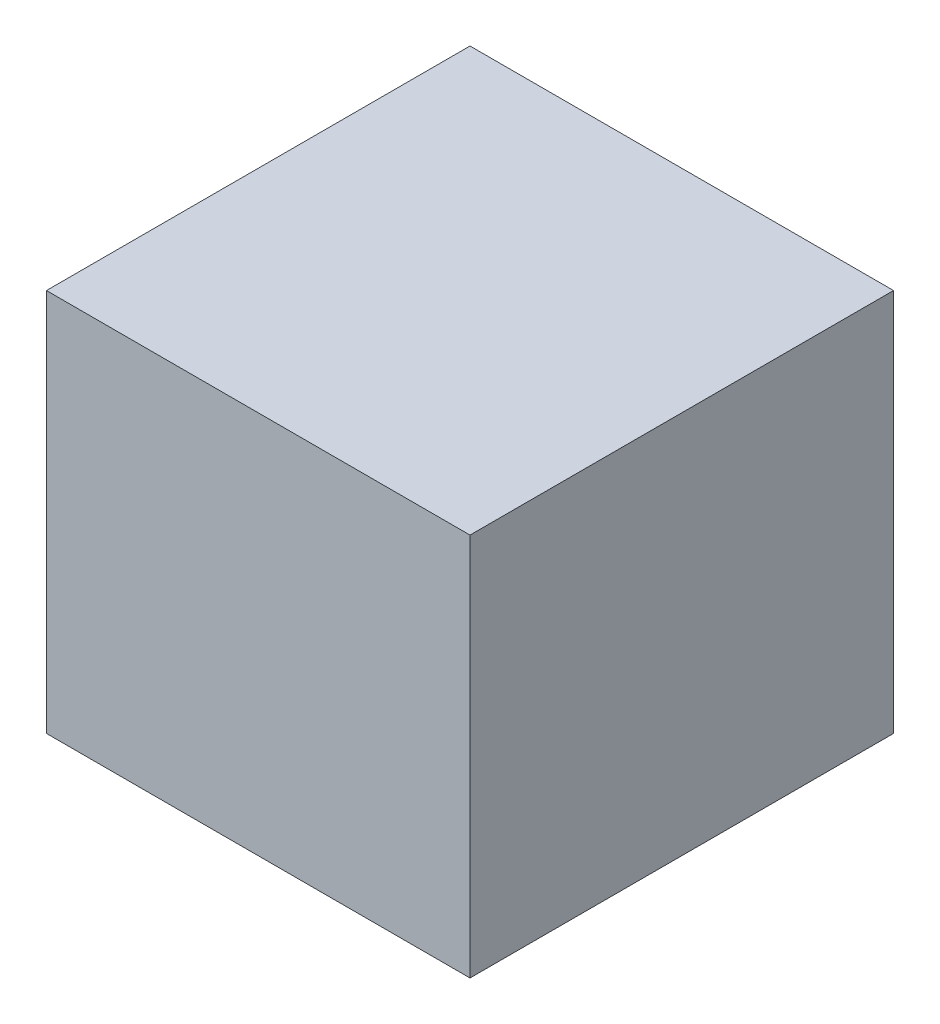
ISO-10303-21;
HEADER;
FILE_DESCRIPTION(('STEP AP214'),'2;1');
FILE_NAME('part.step','',(''),(''),'','','');
FILE_SCHEMA(('AUTOMOTIVE_DESIGN { 1 0 10303 214 1 1 1 1 }'));
ENDSEC;
DATA;
#1=APPLICATION_CONTEXT('core data for automotive mechanical design processes');
#2=APPLICATION_PROTOCOL_DEFINITION('international standard','automotive_design',2000,#1);
#3=PRODUCT_CONTEXT('',#1,'mechanical');
#4=PRODUCT('Part','Part','',(#3));
#5=PRODUCT_RELATED_PRODUCT_CATEGORY('part','',(#4));
#6=PRODUCT_DEFINITION_FORMATION('','',#4);
#7=PRODUCT_DEFINITION_CONTEXT('part definition',#1,'design');
#8=PRODUCT_DEFINITION('design','',#6,#7);
#9=PRODUCT_DEFINITION_SHAPE('','',#8);
#10=(LENGTH_UNIT() NAMED_UNIT(*) SI_UNIT(.MILLI.,.METRE.));
#11=(NAMED_UNIT(*) PLANE_ANGLE_UNIT() SI_UNIT($,.RADIAN.));
#12=(NAMED_UNIT(*) SI_UNIT($,.STERADIAN.) SOLID_ANGLE_UNIT());
#13=UNCERTAINTY_MEASURE_WITH_UNIT(LENGTH_MEASURE(1.E-05),#10,'distance_accuracy_value','');
#14=(GEOMETRIC_REPRESENTATION_CONTEXT(3) GLOBAL_UNCERTAINTY_ASSIGNED_CONTEXT((#13)) GLOBAL_UNIT_ASSIGNED_CONTEXT((#10,
#11,#12)) REPRESENTATION_CONTEXT('',''));
#15=CARTESIAN_POINT('',(0.,0.,0.));
#16=DIRECTION('',(0.,0.,1.));
#17=DIRECTION('',(1.,0.,0.));
#18=AXIS2_PLACEMENT_3D('',#15,#16,#17);
#19=CARTESIAN_POINT('',(15.9,28.8,15.9));
#20=DIRECTION('',(-1.,0.,0.));
#21=DIRECTION('',(0.,0.,1.));
#22=AXIS2_PLACEMENT_3D('',#19,#20,#21);
#23=PLANE('',#22);
#24=DIRECTION('',(0.,0.,-1.));
#25=VECTOR('',#24,1.);
#26=CARTESIAN_POINT('',(15.9,0.,15.9));
#27=LINE('',#26,#25);
#28=CARTESIAN_POINT('',(15.9,0.,15.9));
#29=VERTEX_POINT('',#28);
#30=CARTESIAN_POINT('',(15.9,0.,-15.9));
#31=VERTEX_POINT('',#30);
#32=EDGE_CURVE('E107',#29,#31,#27,.T.);
#33=ORIENTED_EDGE('',*,*,#32,.T.);
#34=DIRECTION('',(0.,-1.,0.));
#35=VECTOR('',#34,1.);
#36=CARTESIAN_POINT('',(15.9,28.8,-15.9));
#37=LINE('',#36,#35);
#38=CARTESIAN_POINT('',(15.9,28.8,-15.9));
#39=VERTEX_POINT('',#38);
#40=EDGE_CURVE('E11',#39,#31,#37,.T.);
#41=ORIENTED_EDGE('',*,*,#40,.F.);
#42=DIRECTION('',(0.,0.,-1.));
#43=VECTOR('',#42,1.);
#44=CARTESIAN_POINT('',(15.9,28.8,15.9));
#45=LINE('',#44,#43);
#46=CARTESIAN_POINT('',(15.9,28.8,15.9));
#47=VERTEX_POINT('',#46);
#48=EDGE_CURVE('E91',#47,#39,#45,.T.);
#49=ORIENTED_EDGE('',*,*,#48,.F.);
#50=DIRECTION('',(0.,-1.,0.));
#51=VECTOR('',#50,1.);
#52=CARTESIAN_POINT('',(15.9,28.8,15.9));
#53=LINE('',#52,#51);
#54=EDGE_CURVE('E103',#47,#29,#53,.T.);
#55=ORIENTED_EDGE('',*,*,#54,.T.);
#56=EDGE_LOOP('',(#33,#41,#49,#55));
#57=FACE_BOUND('',#56,.T.);
#58=ADVANCED_FACE('F39',(#57),#23,.F.);
#59=CARTESIAN_POINT('',(-15.9,28.8,-15.9));
#60=DIRECTION('',(0.,0.,1.));
#61=DIRECTION('',(1.,0.,0.));
#62=AXIS2_PLACEMENT_3D('',#59,#60,#61);
#63=PLANE('',#62);
#64=DIRECTION('',(-1.,0.,0.));
#65=VECTOR('',#64,1.);
#66=CARTESIAN_POINT('',(-15.9,0.,-15.9));
#67=LINE('',#66,#65);
#68=CARTESIAN_POINT('',(-15.9,0.,-15.9));
#69=VERTEX_POINT('',#68);
#70=EDGE_CURVE('E96',#31,#69,#67,.T.);
#71=ORIENTED_EDGE('',*,*,#70,.T.);
#72=DIRECTION('',(0.,-1.,0.));
#73=VECTOR('',#72,1.);
#74=CARTESIAN_POINT('',(-15.9,28.8,-15.9));
#75=LINE('',#74,#73);
#76=CARTESIAN_POINT('',(-15.9,28.8,-15.9));
#77=VERTEX_POINT('',#76);
#78=EDGE_CURVE('E48',#77,#69,#75,.T.);
#79=ORIENTED_EDGE('',*,*,#78,.F.);
#80=DIRECTION('',(-1.,0.,0.));
#81=VECTOR('',#80,1.);
#82=CARTESIAN_POINT('',(-15.9,28.8,-15.9));
#83=LINE('',#82,#81);
#84=EDGE_CURVE('E86',#39,#77,#83,.T.);
#85=ORIENTED_EDGE('',*,*,#84,.F.);
#86=ORIENTED_EDGE('',*,*,#40,.T.);
#87=EDGE_LOOP('',(#71,#79,#85,#86));
#88=FACE_BOUND('',#87,.T.);
#89=ADVANCED_FACE('F95',(#88),#63,.F.);
#90=CARTESIAN_POINT('',(-15.9,28.8,15.9));
#91=DIRECTION('',(1.,0.,0.));
#92=DIRECTION('',(0.,0.,-1.));
#93=AXIS2_PLACEMENT_3D('',#90,#91,#92);
#94=PLANE('',#93);
#95=DIRECTION('',(0.,0.,1.));
#96=VECTOR('',#95,1.);
#97=CARTESIAN_POINT('',(-15.9,0.,15.9));
#98=LINE('',#97,#96);
#99=CARTESIAN_POINT('',(-15.9,0.,15.9));
#100=VERTEX_POINT('',#99);
#101=EDGE_CURVE('E73',#69,#100,#98,.T.);
#102=ORIENTED_EDGE('',*,*,#101,.T.);
#103=DIRECTION('',(0.,-1.,0.));
#104=VECTOR('',#103,1.);
#105=CARTESIAN_POINT('',(-15.9,28.8,15.9));
#106=LINE('',#105,#104);
#107=CARTESIAN_POINT('',(-15.9,28.8,15.9));
#108=VERTEX_POINT('',#107);
#109=EDGE_CURVE('E98',#108,#100,#106,.T.);
#110=ORIENTED_EDGE('',*,*,#109,.F.);
#111=DIRECTION('',(0.,0.,1.));
#112=VECTOR('',#111,1.);
#113=CARTESIAN_POINT('',(-15.9,28.8,15.9));
#114=LINE('',#113,#112);
#115=EDGE_CURVE('E89',#77,#108,#114,.T.);
#116=ORIENTED_EDGE('',*,*,#115,.F.);
#117=ORIENTED_EDGE('',*,*,#78,.T.);
#118=EDGE_LOOP('',(#102,#110,#116,#117));
#119=FACE_BOUND('',#118,.T.);
#120=ADVANCED_FACE('F99',(#119),#94,.F.);
#121=CARTESIAN_POINT('',(-15.9,28.8,15.9));
#122=DIRECTION('',(0.,0.,-1.));
#123=DIRECTION('',(-1.,0.,0.));
#124=AXIS2_PLACEMENT_3D('',#121,#122,#123);
#125=PLANE('',#124);
#126=DIRECTION('',(1.,0.,0.));
#127=VECTOR('',#126,1.);
#128=CARTESIAN_POINT('',(-15.9,0.,15.9));
#129=LINE('',#128,#127);
#130=EDGE_CURVE('E79',#100,#29,#129,.T.);
#131=ORIENTED_EDGE('',*,*,#130,.T.);
#132=ORIENTED_EDGE('',*,*,#54,.F.);
#133=DIRECTION('',(1.,0.,0.));
#134=VECTOR('',#133,1.);
#135=CARTESIAN_POINT('',(-15.9,28.8,15.9));
#136=LINE('',#135,#134);
#137=EDGE_CURVE('E56',#108,#47,#136,.T.);
#138=ORIENTED_EDGE('',*,*,#137,.F.);
#139=ORIENTED_EDGE('',*,*,#109,.T.);
#140=EDGE_LOOP('',(#131,#132,#138,#139));
#141=FACE_BOUND('',#140,.T.);
#142=ADVANCED_FACE('F120',(#141),#125,.F.);
#143=CARTESIAN_POINT('',(0.,28.8,0.));
#144=DIRECTION('',(0.,-1.,0.));
#145=DIRECTION('',(0.,0.,-1.));
#146=AXIS2_PLACEMENT_3D('',#143,#144,#145);
#147=PLANE('',#146);
#148=ORIENTED_EDGE('',*,*,#48,.T.);
#149=ORIENTED_EDGE('',*,*,#84,.T.);
#150=ORIENTED_EDGE('',*,*,#115,.T.);
#151=ORIENTED_EDGE('',*,*,#137,.T.);
#152=EDGE_LOOP('',(#148,#149,#150,#151));
#153=FACE_BOUND('',#152,.T.);
#154=ADVANCED_FACE('F87',(#153),#147,.F.);
#155=CARTESIAN_POINT('',(0.,0.,0.));
#156=DIRECTION('',(0.,-1.,0.));
#157=DIRECTION('',(0.,0.,-1.));
#158=AXIS2_PLACEMENT_3D('',#155,#156,#157);
#159=PLANE('',#158);
#160=ORIENTED_EDGE('',*,*,#32,.F.);
#161=ORIENTED_EDGE('',*,*,#130,.F.);
#162=ORIENTED_EDGE('',*,*,#101,.F.);
#163=ORIENTED_EDGE('',*,*,#70,.F.);
#164=EDGE_LOOP('',(#160,#161,#162,#163));
#165=FACE_BOUND('',#164,.T.);
#166=ADVANCED_FACE('F123',(#165),#159,.T.);
#167=CLOSED_SHELL('',(#58,#89,#120,#142,#154,#166));
#168=MANIFOLD_SOLID_BREP('B2',#167);
#169=ADVANCED_BREP_SHAPE_REPRESENTATION('',(#18,#168),#14);
#170=SHAPE_DEFINITION_REPRESENTATION(#9,#169);
ENDSEC;
END-ISO-10303-21;
